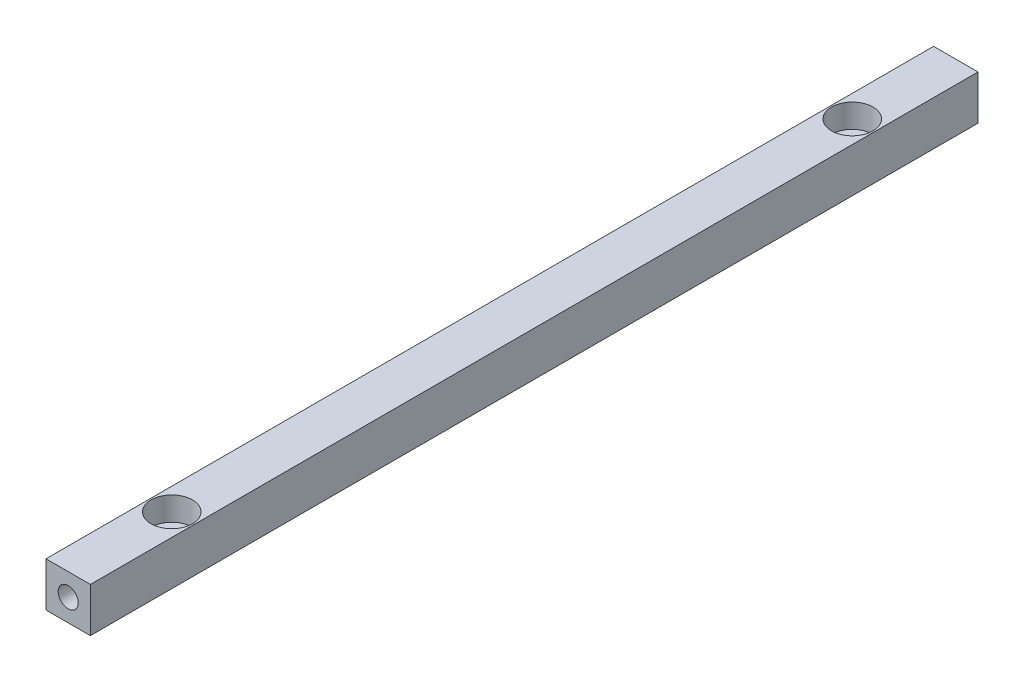
ISO-10303-21;
HEADER;
FILE_DESCRIPTION(('STEP AP214'),'2;1');
FILE_NAME('part.step','',(''),(''),'','','');
FILE_SCHEMA(('AUTOMOTIVE_DESIGN { 1 0 10303 214 1 1 1 1 }'));
ENDSEC;
DATA;
#1=APPLICATION_CONTEXT('core data for automotive mechanical design processes');
#2=APPLICATION_PROTOCOL_DEFINITION('international standard','automotive_design',2000,#1);
#3=PRODUCT_CONTEXT('',#1,'mechanical');
#4=PRODUCT('Part','Part','',(#3));
#5=PRODUCT_RELATED_PRODUCT_CATEGORY('part','',(#4));
#6=PRODUCT_DEFINITION_FORMATION('','',#4);
#7=PRODUCT_DEFINITION_CONTEXT('part definition',#1,'design');
#8=PRODUCT_DEFINITION('design','',#6,#7);
#9=PRODUCT_DEFINITION_SHAPE('','',#8);
#10=(LENGTH_UNIT() NAMED_UNIT(*) SI_UNIT(.MILLI.,.METRE.));
#11=(NAMED_UNIT(*) PLANE_ANGLE_UNIT() SI_UNIT($,.RADIAN.));
#12=(NAMED_UNIT(*) SI_UNIT($,.STERADIAN.) SOLID_ANGLE_UNIT());
#13=UNCERTAINTY_MEASURE_WITH_UNIT(LENGTH_MEASURE(1.E-05),#10,'distance_accuracy_value','');
#14=(GEOMETRIC_REPRESENTATION_CONTEXT(3) GLOBAL_UNCERTAINTY_ASSIGNED_CONTEXT((#13)) GLOBAL_UNIT_ASSIGNED_CONTEXT((#10,
#11,#12)) REPRESENTATION_CONTEXT('',''));
#15=CARTESIAN_POINT('',(0.,0.,0.));
#16=DIRECTION('',(0.,0.,1.));
#17=DIRECTION('',(1.,0.,0.));
#18=AXIS2_PLACEMENT_3D('',#15,#16,#17);
#19=CARTESIAN_POINT('',(7.5,7.5,150.));
#20=DIRECTION('',(-1.,0.,0.));
#21=DIRECTION('',(0.,-1.,0.));
#22=AXIS2_PLACEMENT_3D('',#19,#20,#21);
#23=PLANE('',#22);
#24=DIRECTION('',(0.,1.,0.));
#25=VECTOR('',#24,1.);
#26=CARTESIAN_POINT('',(7.5,7.5,-150.));
#27=LINE('',#26,#25);
#28=CARTESIAN_POINT('',(7.5,-7.5,-150.));
#29=VERTEX_POINT('',#28);
#30=CARTESIAN_POINT('',(7.5,7.5,-150.));
#31=VERTEX_POINT('',#30);
#32=EDGE_CURVE('E117',#29,#31,#27,.T.);
#33=ORIENTED_EDGE('',*,*,#32,.T.);
#34=DIRECTION('',(0.,0.,-1.));
#35=VECTOR('',#34,1.);
#36=CARTESIAN_POINT('',(7.5,7.5,150.));
#37=LINE('',#36,#35);
#38=CARTESIAN_POINT('',(7.5,7.5,150.));
#39=VERTEX_POINT('',#38);
#40=EDGE_CURVE('E11',#39,#31,#37,.T.);
#41=ORIENTED_EDGE('',*,*,#40,.F.);
#42=DIRECTION('',(0.,1.,0.));
#43=VECTOR('',#42,1.);
#44=CARTESIAN_POINT('',(7.5,7.5,150.));
#45=LINE('',#44,#43);
#46=CARTESIAN_POINT('',(7.5,-7.5,150.));
#47=VERTEX_POINT('',#46);
#48=EDGE_CURVE('E118',#47,#39,#45,.T.);
#49=ORIENTED_EDGE('',*,*,#48,.F.);
#50=DIRECTION('',(0.,0.,-1.));
#51=VECTOR('',#50,1.);
#52=CARTESIAN_POINT('',(7.5,-7.5,150.));
#53=LINE('',#52,#51);
#54=EDGE_CURVE('E124',#47,#29,#53,.T.);
#55=ORIENTED_EDGE('',*,*,#54,.T.);
#56=EDGE_LOOP('',(#33,#41,#49,#55));
#57=FACE_BOUND('',#56,.T.);
#58=ADVANCED_FACE('F40',(#57),#23,.F.);
#59=CARTESIAN_POINT('',(-7.5,7.5,150.));
#60=DIRECTION('',(0.,-1.,0.));
#61=DIRECTION('',(0.,0.,-1.));
#62=AXIS2_PLACEMENT_3D('',#59,#60,#61);
#63=PLANE('',#62);
#64=CARTESIAN_POINT('',(0.,7.5,115.));
#65=DIRECTION('',(0.,1.,0.));
#66=DIRECTION('',(0.,0.,1.));
#67=AXIS2_PLACEMENT_3D('',#64,#65,#66);
#68=CIRCLE('',#67,7.00000000000001);
#69=CARTESIAN_POINT('',(0.,7.5,122.));
#70=VERTEX_POINT('',#69);
#71=EDGE_CURVE('E167',#70,#70,#68,.T.);
#72=ORIENTED_EDGE('',*,*,#71,.F.);
#73=EDGE_LOOP('',(#72));
#74=FACE_BOUND('',#73,.T.);
#75=CARTESIAN_POINT('',(0.,7.5,-115.));
#76=DIRECTION('',(0.,1.,0.));
#77=DIRECTION('',(0.,0.,1.));
#78=AXIS2_PLACEMENT_3D('',#75,#76,#77);
#79=CIRCLE('',#78,7.00000000000001);
#80=CARTESIAN_POINT('',(0.,7.5,-108.));
#81=VERTEX_POINT('',#80);
#82=EDGE_CURVE('E170',#81,#81,#79,.T.);
#83=ORIENTED_EDGE('',*,*,#82,.F.);
#84=EDGE_LOOP('',(#83));
#85=FACE_BOUND('',#84,.T.);
#86=DIRECTION('',(-1.,0.,0.));
#87=VECTOR('',#86,1.);
#88=CARTESIAN_POINT('',(-7.5,7.5,-150.));
#89=LINE('',#88,#87);
#90=CARTESIAN_POINT('',(-7.5,7.5,-150.));
#91=VERTEX_POINT('',#90);
#92=EDGE_CURVE('E127',#31,#91,#89,.T.);
#93=ORIENTED_EDGE('',*,*,#92,.T.);
#94=DIRECTION('',(0.,0.,-1.));
#95=VECTOR('',#94,1.);
#96=CARTESIAN_POINT('',(-7.5,7.5,150.));
#97=LINE('',#96,#95);
#98=CARTESIAN_POINT('',(-7.5,7.5,150.));
#99=VERTEX_POINT('',#98);
#100=EDGE_CURVE('E48',#99,#91,#97,.T.);
#101=ORIENTED_EDGE('',*,*,#100,.F.);
#102=DIRECTION('',(-1.,0.,0.));
#103=VECTOR('',#102,1.);
#104=CARTESIAN_POINT('',(-7.5,7.5,150.));
#105=LINE('',#104,#103);
#106=EDGE_CURVE('E87',#39,#99,#105,.T.);
#107=ORIENTED_EDGE('',*,*,#106,.F.);
#108=ORIENTED_EDGE('',*,*,#40,.T.);
#109=EDGE_LOOP('',(#93,#101,#107,#108));
#110=FACE_BOUND('',#109,.T.);
#111=ADVANCED_FACE('F152',(#74,#85,#110),#63,.F.);
#112=CARTESIAN_POINT('',(-7.5,7.5,150.));
#113=DIRECTION('',(1.,0.,0.));
#114=DIRECTION('',(0.,1.,0.));
#115=AXIS2_PLACEMENT_3D('',#112,#113,#114);
#116=PLANE('',#115);
#117=DIRECTION('',(0.,-1.,0.));
#118=VECTOR('',#117,1.);
#119=CARTESIAN_POINT('',(-7.5,7.5,-150.));
#120=LINE('',#119,#118);
#121=CARTESIAN_POINT('',(-7.5,-7.5,-150.));
#122=VERTEX_POINT('',#121);
#123=EDGE_CURVE('E74',#91,#122,#120,.T.);
#124=ORIENTED_EDGE('',*,*,#123,.T.);
#125=DIRECTION('',(0.,0.,-1.));
#126=VECTOR('',#125,1.);
#127=CARTESIAN_POINT('',(-7.5,-7.5,150.));
#128=LINE('',#127,#126);
#129=CARTESIAN_POINT('',(-7.5,-7.5,150.));
#130=VERTEX_POINT('',#129);
#131=EDGE_CURVE('E132',#130,#122,#128,.T.);
#132=ORIENTED_EDGE('',*,*,#131,.F.);
#133=DIRECTION('',(0.,-1.,0.));
#134=VECTOR('',#133,1.);
#135=CARTESIAN_POINT('',(-7.5,7.5,150.));
#136=LINE('',#135,#134);
#137=EDGE_CURVE('E121',#99,#130,#136,.T.);
#138=ORIENTED_EDGE('',*,*,#137,.F.);
#139=ORIENTED_EDGE('',*,*,#100,.T.);
#140=EDGE_LOOP('',(#124,#132,#138,#139));
#141=FACE_BOUND('',#140,.T.);
#142=ADVANCED_FACE('F134',(#141),#116,.F.);
#143=CARTESIAN_POINT('',(-7.5,-7.5,150.));
#144=DIRECTION('',(0.,1.,0.));
#145=DIRECTION('',(0.,0.,1.));
#146=AXIS2_PLACEMENT_3D('',#143,#144,#145);
#147=PLANE('',#146);
#148=CARTESIAN_POINT('',(0.,-7.5,115.));
#149=DIRECTION('',(0.,1.,0.));
#150=DIRECTION('',(0.,0.,1.));
#151=AXIS2_PLACEMENT_3D('',#148,#149,#150);
#152=CIRCLE('',#151,4.25000000000001);
#153=CARTESIAN_POINT('',(0.,-7.5,119.25));
#154=VERTEX_POINT('',#153);
#155=EDGE_CURVE('E173',#154,#154,#152,.T.);
#156=ORIENTED_EDGE('',*,*,#155,.T.);
#157=EDGE_LOOP('',(#156));
#158=FACE_BOUND('',#157,.T.);
#159=CARTESIAN_POINT('',(0.,-7.5,-115.));
#160=DIRECTION('',(0.,1.,0.));
#161=DIRECTION('',(0.,0.,1.));
#162=AXIS2_PLACEMENT_3D('',#159,#160,#161);
#163=CIRCLE('',#162,4.25000000000001);
#164=CARTESIAN_POINT('',(0.,-7.5,-110.75));
#165=VERTEX_POINT('',#164);
#166=EDGE_CURVE('E111',#165,#165,#163,.T.);
#167=ORIENTED_EDGE('',*,*,#166,.T.);
#168=EDGE_LOOP('',(#167));
#169=FACE_BOUND('',#168,.T.);
#170=DIRECTION('',(1.,0.,0.));
#171=VECTOR('',#170,1.);
#172=CARTESIAN_POINT('',(-7.5,-7.5,-150.));
#173=LINE('',#172,#171);
#174=EDGE_CURVE('E80',#122,#29,#173,.T.);
#175=ORIENTED_EDGE('',*,*,#174,.T.);
#176=ORIENTED_EDGE('',*,*,#54,.F.);
#177=DIRECTION('',(1.,0.,0.));
#178=VECTOR('',#177,1.);
#179=CARTESIAN_POINT('',(-7.5,-7.5,150.));
#180=LINE('',#179,#178);
#181=EDGE_CURVE('E56',#130,#47,#180,.T.);
#182=ORIENTED_EDGE('',*,*,#181,.F.);
#183=ORIENTED_EDGE('',*,*,#131,.T.);
#184=EDGE_LOOP('',(#175,#176,#182,#183));
#185=FACE_BOUND('',#184,.T.);
#186=ADVANCED_FACE('F141',(#158,#169,#185),#147,.F.);
#187=CARTESIAN_POINT('',(0.,0.,150.));
#188=DIRECTION('',(0.,0.,1.));
#189=DIRECTION('',(1.,0.,0.));
#190=AXIS2_PLACEMENT_3D('',#187,#188,#189);
#191=PLANE('',#190);
#192=CARTESIAN_POINT('',(0.,0.,150.));
#193=DIRECTION('',(0.,0.,1.));
#194=DIRECTION('',(1.,0.,0.));
#195=AXIS2_PLACEMENT_3D('',#192,#193,#194);
#196=CIRCLE('',#195,3.39999999999999);
#197=CARTESIAN_POINT('',(3.39999999999999,0.,150.));
#198=VERTEX_POINT('',#197);
#199=EDGE_CURVE('E104',#198,#198,#196,.T.);
#200=ORIENTED_EDGE('',*,*,#199,.F.);
#201=EDGE_LOOP('',(#200));
#202=FACE_BOUND('',#201,.T.);
#203=ORIENTED_EDGE('',*,*,#48,.T.);
#204=ORIENTED_EDGE('',*,*,#106,.T.);
#205=ORIENTED_EDGE('',*,*,#137,.T.);
#206=ORIENTED_EDGE('',*,*,#181,.T.);
#207=EDGE_LOOP('',(#203,#204,#205,#206));
#208=FACE_BOUND('',#207,.T.);
#209=ADVANCED_FACE('F143',(#202,#208),#191,.T.);
#210=CARTESIAN_POINT('',(0.,0.,-150.));
#211=DIRECTION('',(0.,0.,1.));
#212=DIRECTION('',(1.,0.,0.));
#213=AXIS2_PLACEMENT_3D('',#210,#211,#212);
#214=PLANE('',#213);
#215=CARTESIAN_POINT('',(0.,0.,-150.));
#216=DIRECTION('',(0.,0.,-1.));
#217=DIRECTION('',(-1.,0.,0.));
#218=AXIS2_PLACEMENT_3D('',#215,#216,#217);
#219=CIRCLE('',#218,3.39999999999999);
#220=CARTESIAN_POINT('',(-3.39999999999999,0.,-150.));
#221=VERTEX_POINT('',#220);
#222=EDGE_CURVE('E105',#221,#221,#219,.T.);
#223=ORIENTED_EDGE('',*,*,#222,.F.);
#224=EDGE_LOOP('',(#223));
#225=FACE_BOUND('',#224,.T.);
#226=ORIENTED_EDGE('',*,*,#32,.F.);
#227=ORIENTED_EDGE('',*,*,#174,.F.);
#228=ORIENTED_EDGE('',*,*,#123,.F.);
#229=ORIENTED_EDGE('',*,*,#92,.F.);
#230=EDGE_LOOP('',(#226,#227,#228,#229));
#231=FACE_BOUND('',#230,.T.);
#232=ADVANCED_FACE('F137',(#225,#231),#214,.F.);
#233=CARTESIAN_POINT('',(0.,0.,127.75));
#234=DIRECTION('',(0.,0.,1.));
#235=DIRECTION('',(1.,0.,0.));
#236=AXIS2_PLACEMENT_3D('',#233,#234,#235);
#237=CONICAL_SURFACE('',#236,3.39999999999999,1.02974425867665);
#238=CARTESIAN_POINT('',(0.,0.,125.707073895306));
#239=VERTEX_POINT('',#238);
#240=VERTEX_LOOP('',#239);
#241=FACE_BOUND('',#240,.T.);
#242=CARTESIAN_POINT('',(0.,0.,127.75));
#243=DIRECTION('',(0.,0.,1.));
#244=DIRECTION('',(1.,0.,0.));
#245=AXIS2_PLACEMENT_3D('',#242,#243,#244);
#246=CIRCLE('',#245,3.39999999999999);
#247=CARTESIAN_POINT('',(3.39999999999999,0.,127.75));
#248=VERTEX_POINT('',#247);
#249=EDGE_CURVE('E108',#248,#248,#246,.T.);
#250=ORIENTED_EDGE('',*,*,#249,.T.);
#251=EDGE_LOOP('',(#250));
#252=FACE_BOUND('',#251,.T.);
#253=ADVANCED_FACE('F214',(#241,#252),#237,.F.);
#254=CARTESIAN_POINT('',(0.,0.,150.));
#255=DIRECTION('',(0.,0.,1.));
#256=DIRECTION('',(1.,0.,0.));
#257=AXIS2_PLACEMENT_3D('',#254,#255,#256);
#258=CYLINDRICAL_SURFACE('',#257,3.39999999999999);
#259=ORIENTED_EDGE('',*,*,#249,.F.);
#260=EDGE_LOOP('',(#259));
#261=FACE_BOUND('',#260,.T.);
#262=ORIENTED_EDGE('',*,*,#199,.T.);
#263=EDGE_LOOP('',(#262));
#264=FACE_BOUND('',#263,.T.);
#265=ADVANCED_FACE('F98',(#261,#264),#258,.F.);
#266=CARTESIAN_POINT('',(0.,0.,-127.75));
#267=DIRECTION('',(0.,0.,-1.));
#268=DIRECTION('',(-1.,0.,0.));
#269=AXIS2_PLACEMENT_3D('',#266,#267,#268);
#270=CONICAL_SURFACE('',#269,3.39999999999999,1.02974425867665);
#271=CARTESIAN_POINT('',(0.,0.,-125.707073895306));
#272=VERTEX_POINT('',#271);
#273=VERTEX_LOOP('',#272);
#274=FACE_BOUND('',#273,.T.);
#275=CARTESIAN_POINT('',(0.,0.,-127.75));
#276=DIRECTION('',(0.,0.,-1.));
#277=DIRECTION('',(-1.,0.,0.));
#278=AXIS2_PLACEMENT_3D('',#275,#276,#277);
#279=CIRCLE('',#278,3.39999999999999);
#280=CARTESIAN_POINT('',(-3.39999999999999,0.,-127.75));
#281=VERTEX_POINT('',#280);
#282=EDGE_CURVE('E102',#281,#281,#279,.T.);
#283=ORIENTED_EDGE('',*,*,#282,.T.);
#284=EDGE_LOOP('',(#283));
#285=FACE_BOUND('',#284,.T.);
#286=ADVANCED_FACE('F94',(#274,#285),#270,.F.);
#287=CARTESIAN_POINT('',(0.,0.,-150.));
#288=DIRECTION('',(0.,0.,-1.));
#289=DIRECTION('',(-1.,0.,0.));
#290=AXIS2_PLACEMENT_3D('',#287,#288,#289);
#291=CYLINDRICAL_SURFACE('',#290,3.39999999999999);
#292=ORIENTED_EDGE('',*,*,#282,.F.);
#293=EDGE_LOOP('',(#292));
#294=FACE_BOUND('',#293,.T.);
#295=ORIENTED_EDGE('',*,*,#222,.T.);
#296=EDGE_LOOP('',(#295));
#297=FACE_BOUND('',#296,.T.);
#298=ADVANCED_FACE('F97',(#294,#297),#291,.F.);
#299=CARTESIAN_POINT('',(0.,7.5,-115.));
#300=DIRECTION('',(0.,1.,0.));
#301=DIRECTION('',(0.,0.,1.));
#302=AXIS2_PLACEMENT_3D('',#299,#300,#301);
#303=CYLINDRICAL_SURFACE('',#302,4.25000000000001);
#304=ORIENTED_EDGE('',*,*,#166,.F.);
#305=EDGE_LOOP('',(#304));
#306=FACE_BOUND('',#305,.T.);
#307=CARTESIAN_POINT('',(0.,-0.500000000000003,-115.));
#308=DIRECTION('',(0.,1.,0.));
#309=DIRECTION('',(0.,0.,1.));
#310=AXIS2_PLACEMENT_3D('',#307,#308,#309);
#311=CIRCLE('',#310,4.25000000000001);
#312=CARTESIAN_POINT('',(0.,-0.500000000000003,-110.75));
#313=VERTEX_POINT('',#312);
#314=EDGE_CURVE('E176',#313,#313,#311,.T.);
#315=ORIENTED_EDGE('',*,*,#314,.T.);
#316=EDGE_LOOP('',(#315));
#317=FACE_BOUND('',#316,.T.);
#318=ADVANCED_FACE('F186',(#306,#317),#303,.F.);
#319=CARTESIAN_POINT('',(4.25000000000001,-0.500000000000003,-115.));
#320=DIRECTION('',(0.,-1.,0.));
#321=DIRECTION('',(0.,0.,-1.));
#322=AXIS2_PLACEMENT_3D('',#319,#320,#321);
#323=PLANE('',#322);
#324=ORIENTED_EDGE('',*,*,#314,.F.);
#325=EDGE_LOOP('',(#324));
#326=FACE_BOUND('',#325,.T.);
#327=CARTESIAN_POINT('',(0.,-0.500000000000003,-115.));
#328=DIRECTION('',(0.,1.,0.));
#329=DIRECTION('',(0.,0.,1.));
#330=AXIS2_PLACEMENT_3D('',#327,#328,#329);
#331=CIRCLE('',#330,7.00000000000001);
#332=CARTESIAN_POINT('',(0.,-0.500000000000003,-108.));
#333=VERTEX_POINT('',#332);
#334=EDGE_CURVE('E172',#333,#333,#331,.T.);
#335=ORIENTED_EDGE('',*,*,#334,.T.);
#336=EDGE_LOOP('',(#335));
#337=FACE_BOUND('',#336,.T.);
#338=ADVANCED_FACE('F189',(#326,#337),#323,.F.);
#339=CARTESIAN_POINT('',(0.,7.5,-115.));
#340=DIRECTION('',(0.,1.,0.));
#341=DIRECTION('',(0.,0.,1.));
#342=AXIS2_PLACEMENT_3D('',#339,#340,#341);
#343=CYLINDRICAL_SURFACE('',#342,7.00000000000001);
#344=ORIENTED_EDGE('',*,*,#334,.F.);
#345=EDGE_LOOP('',(#344));
#346=FACE_BOUND('',#345,.T.);
#347=ORIENTED_EDGE('',*,*,#82,.T.);
#348=EDGE_LOOP('',(#347));
#349=FACE_BOUND('',#348,.T.);
#350=ADVANCED_FACE('F195',(#346,#349),#343,.F.);
#351=CARTESIAN_POINT('',(0.,7.5,115.));
#352=DIRECTION('',(0.,1.,0.));
#353=DIRECTION('',(0.,0.,1.));
#354=AXIS2_PLACEMENT_3D('',#351,#352,#353);
#355=CYLINDRICAL_SURFACE('',#354,4.25000000000001);
#356=ORIENTED_EDGE('',*,*,#155,.F.);
#357=EDGE_LOOP('',(#356));
#358=FACE_BOUND('',#357,.T.);
#359=CARTESIAN_POINT('',(0.,-0.500000000000003,115.));
#360=DIRECTION('',(0.,1.,0.));
#361=DIRECTION('',(0.,0.,1.));
#362=AXIS2_PLACEMENT_3D('',#359,#360,#361);
#363=CIRCLE('',#362,4.25000000000001);
#364=CARTESIAN_POINT('',(0.,-0.500000000000003,119.25));
#365=VERTEX_POINT('',#364);
#366=EDGE_CURVE('E178',#365,#365,#363,.T.);
#367=ORIENTED_EDGE('',*,*,#366,.T.);
#368=EDGE_LOOP('',(#367));
#369=FACE_BOUND('',#368,.T.);
#370=ADVANCED_FACE('F200',(#358,#369),#355,.F.);
#371=CARTESIAN_POINT('',(4.25000000000001,-0.500000000000003,115.));
#372=DIRECTION('',(0.,-1.,0.));
#373=DIRECTION('',(0.,0.,-1.));
#374=AXIS2_PLACEMENT_3D('',#371,#372,#373);
#375=PLANE('',#374);
#376=ORIENTED_EDGE('',*,*,#366,.F.);
#377=EDGE_LOOP('',(#376));
#378=FACE_BOUND('',#377,.T.);
#379=CARTESIAN_POINT('',(0.,-0.500000000000003,115.));
#380=DIRECTION('',(0.,1.,0.));
#381=DIRECTION('',(0.,0.,1.));
#382=AXIS2_PLACEMENT_3D('',#379,#380,#381);
#383=CIRCLE('',#382,7.00000000000001);
#384=CARTESIAN_POINT('',(0.,-0.500000000000003,122.));
#385=VERTEX_POINT('',#384);
#386=EDGE_CURVE('E301',#385,#385,#383,.T.);
#387=ORIENTED_EDGE('',*,*,#386,.T.);
#388=EDGE_LOOP('',(#387));
#389=FACE_BOUND('',#388,.T.);
#390=ADVANCED_FACE('F205',(#378,#389),#375,.F.);
#391=CARTESIAN_POINT('',(0.,7.5,115.));
#392=DIRECTION('',(0.,1.,0.));
#393=DIRECTION('',(0.,0.,1.));
#394=AXIS2_PLACEMENT_3D('',#391,#392,#393);
#395=CYLINDRICAL_SURFACE('',#394,7.00000000000001);
#396=ORIENTED_EDGE('',*,*,#386,.F.);
#397=EDGE_LOOP('',(#396));
#398=FACE_BOUND('',#397,.T.);
#399=ORIENTED_EDGE('',*,*,#71,.T.);
#400=EDGE_LOOP('',(#399));
#401=FACE_BOUND('',#400,.T.);
#402=ADVANCED_FACE('F285',(#398,#401),#395,.F.);
#403=CLOSED_SHELL('',(#58,#111,#142,#186,#209,#232,#253,#265,#286,#298,#318,#338,#350,#370,#390,#402));
#404=MANIFOLD_SOLID_BREP('B2',#403);
#405=ADVANCED_BREP_SHAPE_REPRESENTATION('',(#18,#404),#14);
#406=SHAPE_DEFINITION_REPRESENTATION(#9,#405);
ENDSEC;
END-ISO-10303-21;
